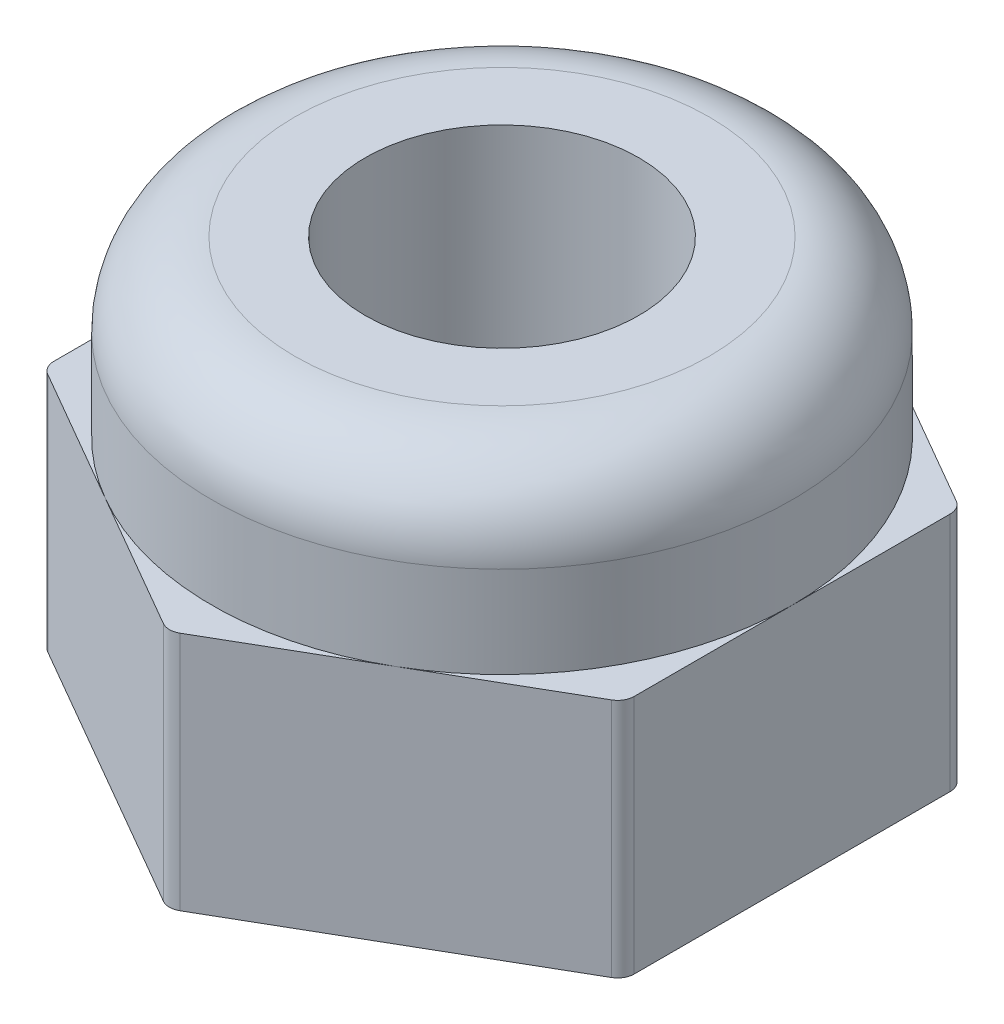
ISO-10303-21;
HEADER;
FILE_DESCRIPTION(('STEP AP214'),'2;1');
FILE_NAME('part.step','',(''),(''),'','','');
FILE_SCHEMA(('AUTOMOTIVE_DESIGN { 1 0 10303 214 1 1 1 1 }'));
ENDSEC;
DATA;
#1=APPLICATION_CONTEXT('core data for automotive mechanical design processes');
#2=APPLICATION_PROTOCOL_DEFINITION('international standard','automotive_design',2000,#1);
#3=PRODUCT_CONTEXT('',#1,'mechanical');
#4=PRODUCT('Part','Part','',(#3));
#5=PRODUCT_RELATED_PRODUCT_CATEGORY('part','',(#4));
#6=PRODUCT_DEFINITION_FORMATION('','',#4);
#7=PRODUCT_DEFINITION_CONTEXT('part definition',#1,'design');
#8=PRODUCT_DEFINITION('design','',#6,#7);
#9=PRODUCT_DEFINITION_SHAPE('','',#8);
#10=(LENGTH_UNIT() NAMED_UNIT(*) SI_UNIT(.MILLI.,.METRE.));
#11=(NAMED_UNIT(*) PLANE_ANGLE_UNIT() SI_UNIT($,.RADIAN.));
#12=(NAMED_UNIT(*) SI_UNIT($,.STERADIAN.) SOLID_ANGLE_UNIT());
#13=UNCERTAINTY_MEASURE_WITH_UNIT(LENGTH_MEASURE(1.E-05),#10,'distance_accuracy_value','');
#14=(GEOMETRIC_REPRESENTATION_CONTEXT(3) GLOBAL_UNCERTAINTY_ASSIGNED_CONTEXT((#13)) GLOBAL_UNIT_ASSIGNED_CONTEXT((#10,
#11,#12)) REPRESENTATION_CONTEXT('',''));
#15=CARTESIAN_POINT('',(0.,0.,0.));
#16=DIRECTION('',(0.,0.,1.));
#17=DIRECTION('',(1.,0.,0.));
#18=AXIS2_PLACEMENT_3D('',#15,#16,#17);
#19=CARTESIAN_POINT('',(0.,0.,0.));
#20=DIRECTION('',(0.,1.,0.));
#21=DIRECTION('',(0.,0.,1.));
#22=AXIS2_PLACEMENT_3D('',#19,#20,#21);
#23=PLANE('',#22);
#24=DIRECTION('',(-0.866025403784439,0.,-0.5));
#25=VECTOR('',#24,1.);
#26=CARTESIAN_POINT('',(3.5,0.,-2.02072594216369));
#27=LINE('',#26,#25);
#28=CARTESIAN_POINT('',(3.4,0.,-2.07846096908265));
#29=VERTEX_POINT('',#28);
#30=CARTESIAN_POINT('',(0.100000000000001,0.,-3.98371685740842));
#31=VERTEX_POINT('',#30);
#32=EDGE_CURVE('E228',#29,#31,#27,.T.);
#33=ORIENTED_EDGE('',*,*,#32,.F.);
#34=CARTESIAN_POINT('',(3.3,0.,-1.90525588832577));
#35=DIRECTION('',(0.,1.,0.));
#36=DIRECTION('',(0.,0.,1.));
#37=AXIS2_PLACEMENT_3D('',#34,#35,#36);
#38=CIRCLE('',#37,0.2);
#39=CARTESIAN_POINT('',(3.5,0.,-1.90525588832577));
#40=VERTEX_POINT('',#39);
#41=EDGE_CURVE('E271',#29,#40,#38,.F.);
#42=ORIENTED_EDGE('',*,*,#41,.T.);
#43=DIRECTION('',(0.,0.,-1.));
#44=VECTOR('',#43,1.);
#45=CARTESIAN_POINT('',(3.5,0.,2.02072594216369));
#46=LINE('',#45,#44);
#47=CARTESIAN_POINT('',(3.5,0.,1.90525588832576));
#48=VERTEX_POINT('',#47);
#49=EDGE_CURVE('E224',#48,#40,#46,.T.);
#50=ORIENTED_EDGE('',*,*,#49,.F.);
#51=CARTESIAN_POINT('',(3.3,0.,1.90525588832576));
#52=DIRECTION('',(0.,1.,0.));
#53=DIRECTION('',(0.,0.,1.));
#54=AXIS2_PLACEMENT_3D('',#51,#52,#53);
#55=CIRCLE('',#54,0.2);
#56=CARTESIAN_POINT('',(3.4,0.,2.07846096908265));
#57=VERTEX_POINT('',#56);
#58=EDGE_CURVE('E268',#48,#57,#55,.F.);
#59=ORIENTED_EDGE('',*,*,#58,.T.);
#60=DIRECTION('',(0.866025403784438,0.,-0.5));
#61=VECTOR('',#60,1.);
#62=CARTESIAN_POINT('',(0.,0.,4.04145188432738));
#63=LINE('',#62,#61);
#64=CARTESIAN_POINT('',(0.0999999999999992,0.,3.98371685740842));
#65=VERTEX_POINT('',#64);
#66=EDGE_CURVE('E186',#65,#57,#63,.T.);
#67=ORIENTED_EDGE('',*,*,#66,.F.);
#68=CARTESIAN_POINT('',(0.,0.,3.81051177665153));
#69=DIRECTION('',(0.,1.,0.));
#70=DIRECTION('',(0.,0.,1.));
#71=AXIS2_PLACEMENT_3D('',#68,#69,#70);
#72=CIRCLE('',#71,0.2);
#73=CARTESIAN_POINT('',(-0.100000000000002,0.,3.98371685740842));
#74=VERTEX_POINT('',#73);
#75=EDGE_CURVE('E265',#65,#74,#72,.F.);
#76=ORIENTED_EDGE('',*,*,#75,.T.);
#77=DIRECTION('',(0.866025403784438,0.,0.5));
#78=VECTOR('',#77,1.);
#79=CARTESIAN_POINT('',(-3.5,0.,2.02072594216369));
#80=LINE('',#79,#78);
#81=CARTESIAN_POINT('',(-3.4,0.,2.07846096908265));
#82=VERTEX_POINT('',#81);
#83=EDGE_CURVE('E176',#82,#74,#80,.T.);
#84=ORIENTED_EDGE('',*,*,#83,.F.);
#85=CARTESIAN_POINT('',(-3.3,0.,1.90525588832577));
#86=DIRECTION('',(0.,1.,0.));
#87=DIRECTION('',(0.,0.,1.));
#88=AXIS2_PLACEMENT_3D('',#85,#86,#87);
#89=CIRCLE('',#88,0.2);
#90=CARTESIAN_POINT('',(-3.5,0.,1.90525588832577));
#91=VERTEX_POINT('',#90);
#92=EDGE_CURVE('E262',#82,#91,#89,.F.);
#93=ORIENTED_EDGE('',*,*,#92,.T.);
#94=DIRECTION('',(0.,0.,1.));
#95=VECTOR('',#94,1.);
#96=CARTESIAN_POINT('',(-3.5,0.,-2.02072594216369));
#97=LINE('',#96,#95);
#98=CARTESIAN_POINT('',(-3.5,0.,-1.90525588832576));
#99=VERTEX_POINT('',#98);
#100=EDGE_CURVE('E235',#99,#91,#97,.T.);
#101=ORIENTED_EDGE('',*,*,#100,.F.);
#102=CARTESIAN_POINT('',(-3.3,0.,-1.90525588832576));
#103=DIRECTION('',(0.,1.,0.));
#104=DIRECTION('',(0.,0.,1.));
#105=AXIS2_PLACEMENT_3D('',#102,#103,#104);
#106=CIRCLE('',#105,0.2);
#107=CARTESIAN_POINT('',(-3.4,0.,-2.07846096908265));
#108=VERTEX_POINT('',#107);
#109=EDGE_CURVE('E259',#99,#108,#106,.F.);
#110=ORIENTED_EDGE('',*,*,#109,.T.);
#111=DIRECTION('',(-0.866025403784438,0.,0.5));
#112=VECTOR('',#111,1.);
#113=CARTESIAN_POINT('',(0.,0.,-4.04145188432738));
#114=LINE('',#113,#112);
#115=CARTESIAN_POINT('',(-0.0999999999999989,0.,-3.98371685740842));
#116=VERTEX_POINT('',#115);
#117=EDGE_CURVE('E232',#116,#108,#114,.T.);
#118=ORIENTED_EDGE('',*,*,#117,.F.);
#119=CARTESIAN_POINT('',(0.,0.,-3.81051177665153));
#120=DIRECTION('',(0.,1.,0.));
#121=DIRECTION('',(0.,0.,1.));
#122=AXIS2_PLACEMENT_3D('',#119,#120,#121);
#123=CIRCLE('',#122,0.2);
#124=EDGE_CURVE('E256',#116,#31,#123,.F.);
#125=ORIENTED_EDGE('',*,*,#124,.T.);
#126=EDGE_LOOP('',(#33,#42,#50,#59,#67,#76,#84,#93,#101,#110,#118,#125));
#127=FACE_BOUND('',#126,.T.);
#128=CARTESIAN_POINT('',(0.,0.,0.));
#129=DIRECTION('',(0.,-1.,0.));
#130=DIRECTION('',(0.,0.,-1.));
#131=AXIS2_PLACEMENT_3D('',#128,#129,#130);
#132=CIRCLE('',#131,2.025);
#133=CARTESIAN_POINT('',(0.,0.,-2.025));
#134=VERTEX_POINT('',#133);
#135=EDGE_CURVE('E590',#134,#134,#132,.T.);
#136=ORIENTED_EDGE('',*,*,#135,.F.);
#137=EDGE_LOOP('',(#136));
#138=FACE_BOUND('',#137,.T.);
#139=ADVANCED_FACE('F41',(#127,#138),#23,.F.);
#140=CARTESIAN_POINT('',(0.,2.9,0.));
#141=DIRECTION('',(0.,1.,0.));
#142=DIRECTION('',(0.,0.,1.));
#143=AXIS2_PLACEMENT_3D('',#140,#141,#142);
#144=PLANE('',#143);
#145=DIRECTION('',(0.866025403784438,0.,-0.5));
#146=VECTOR('',#145,1.);
#147=CARTESIAN_POINT('',(0.,2.9,4.04145188432738));
#148=LINE('',#147,#146);
#149=CARTESIAN_POINT('',(1.75,2.9,3.03108891324553));
#150=VERTEX_POINT('',#149);
#151=CARTESIAN_POINT('',(3.4,2.9,2.07846096908265));
#152=VERTEX_POINT('',#151);
#153=EDGE_CURVE('E165',#150,#152,#148,.T.);
#154=ORIENTED_EDGE('',*,*,#153,.T.);
#155=CARTESIAN_POINT('',(3.3,2.9,1.90525588832576));
#156=DIRECTION('',(0.,1.,0.));
#157=DIRECTION('',(0.,0.,1.));
#158=AXIS2_PLACEMENT_3D('',#155,#156,#157);
#159=CIRCLE('',#158,0.2);
#160=CARTESIAN_POINT('',(3.5,2.9,1.90525588832576));
#161=VERTEX_POINT('',#160);
#162=EDGE_CURVE('E289',#152,#161,#159,.T.);
#163=ORIENTED_EDGE('',*,*,#162,.T.);
#164=DIRECTION('',(0.,0.,-1.));
#165=VECTOR('',#164,1.);
#166=CARTESIAN_POINT('',(3.5,2.9,2.02072594216369));
#167=LINE('',#166,#165);
#168=CARTESIAN_POINT('',(3.5,2.9,0.));
#169=VERTEX_POINT('',#168);
#170=EDGE_CURVE('E181',#161,#169,#167,.T.);
#171=ORIENTED_EDGE('',*,*,#170,.T.);
#172=CARTESIAN_POINT('',(0.,2.9,0.));
#173=DIRECTION('',(0.,1.,0.));
#174=DIRECTION('',(0.,0.,1.));
#175=AXIS2_PLACEMENT_3D('',#172,#173,#174);
#176=CIRCLE('',#175,3.5);
#177=EDGE_CURVE('E178',#150,#169,#176,.T.);
#178=ORIENTED_EDGE('',*,*,#177,.F.);
#179=EDGE_LOOP('',(#154,#163,#171,#178));
#180=FACE_BOUND('',#179,.T.);
#181=ADVANCED_FACE('F179',(#180),#144,.T.);
#182=CARTESIAN_POINT('',(3.5,2.9,-1.90525588832577));
#183=VERTEX_POINT('',#182);
#184=EDGE_CURVE('E164',#169,#183,#167,.T.);
#185=ORIENTED_EDGE('',*,*,#184,.T.);
#186=CARTESIAN_POINT('',(3.3,2.9,-1.90525588832577));
#187=DIRECTION('',(0.,1.,0.));
#188=DIRECTION('',(0.,0.,1.));
#189=AXIS2_PLACEMENT_3D('',#186,#187,#188);
#190=CIRCLE('',#189,0.2);
#191=CARTESIAN_POINT('',(3.4,2.9,-2.07846096908265));
#192=VERTEX_POINT('',#191);
#193=EDGE_CURVE('E281',#183,#192,#190,.T.);
#194=ORIENTED_EDGE('',*,*,#193,.T.);
#195=DIRECTION('',(-0.866025403784439,0.,-0.5));
#196=VECTOR('',#195,1.);
#197=CARTESIAN_POINT('',(3.5,2.9,-2.02072594216369));
#198=LINE('',#197,#196);
#199=CARTESIAN_POINT('',(1.75,2.9,-3.03108891324554));
#200=VERTEX_POINT('',#199);
#201=EDGE_CURVE('E206',#192,#200,#198,.T.);
#202=ORIENTED_EDGE('',*,*,#201,.T.);
#203=EDGE_CURVE('E187',#169,#200,#176,.T.);
#204=ORIENTED_EDGE('',*,*,#203,.F.);
#205=EDGE_LOOP('',(#185,#194,#202,#204));
#206=FACE_BOUND('',#205,.T.);
#207=ADVANCED_FACE('F384',(#206),#144,.T.);
#208=CARTESIAN_POINT('',(0.100000000000001,2.9,-3.98371685740842));
#209=VERTEX_POINT('',#208);
#210=EDGE_CURVE('E205',#200,#209,#198,.T.);
#211=ORIENTED_EDGE('',*,*,#210,.T.);
#212=CARTESIAN_POINT('',(0.,2.9,-3.81051177665153));
#213=DIRECTION('',(0.,1.,0.));
#214=DIRECTION('',(0.,0.,1.));
#215=AXIS2_PLACEMENT_3D('',#212,#213,#214);
#216=CIRCLE('',#215,0.2);
#217=CARTESIAN_POINT('',(-0.0999999999999989,2.9,-3.98371685740842));
#218=VERTEX_POINT('',#217);
#219=EDGE_CURVE('E11',#209,#218,#216,.T.);
#220=ORIENTED_EDGE('',*,*,#219,.T.);
#221=DIRECTION('',(-0.866025403784438,0.,0.5));
#222=VECTOR('',#221,1.);
#223=CARTESIAN_POINT('',(0.,2.9,-4.04145188432738));
#224=LINE('',#223,#222);
#225=CARTESIAN_POINT('',(-1.75,2.9,-3.03108891324553));
#226=VERTEX_POINT('',#225);
#227=EDGE_CURVE('E210',#218,#226,#224,.T.);
#228=ORIENTED_EDGE('',*,*,#227,.T.);
#229=EDGE_CURVE('E378',#200,#226,#176,.T.);
#230=ORIENTED_EDGE('',*,*,#229,.F.);
#231=EDGE_LOOP('',(#211,#220,#228,#230));
#232=FACE_BOUND('',#231,.T.);
#233=ADVANCED_FACE('F382',(#232),#144,.T.);
#234=CARTESIAN_POINT('',(-3.4,2.9,-2.07846096908265));
#235=VERTEX_POINT('',#234);
#236=EDGE_CURVE('E209',#226,#235,#224,.T.);
#237=ORIENTED_EDGE('',*,*,#236,.T.);
#238=CARTESIAN_POINT('',(-3.3,2.9,-1.90525588832576));
#239=DIRECTION('',(0.,1.,0.));
#240=DIRECTION('',(0.,0.,1.));
#241=AXIS2_PLACEMENT_3D('',#238,#239,#240);
#242=CIRCLE('',#241,0.2);
#243=CARTESIAN_POINT('',(-3.5,2.9,-1.90525588832576));
#244=VERTEX_POINT('',#243);
#245=EDGE_CURVE('E51',#235,#244,#242,.T.);
#246=ORIENTED_EDGE('',*,*,#245,.T.);
#247=DIRECTION('',(0.,0.,1.));
#248=VECTOR('',#247,1.);
#249=CARTESIAN_POINT('',(-3.5,2.9,-2.02072594216369));
#250=LINE('',#249,#248);
#251=CARTESIAN_POINT('',(-3.5,2.9,0.));
#252=VERTEX_POINT('',#251);
#253=EDGE_CURVE('E214',#244,#252,#250,.T.);
#254=ORIENTED_EDGE('',*,*,#253,.T.);
#255=EDGE_CURVE('E197',#226,#252,#176,.T.);
#256=ORIENTED_EDGE('',*,*,#255,.F.);
#257=EDGE_LOOP('',(#237,#246,#254,#256));
#258=FACE_BOUND('',#257,.T.);
#259=ADVANCED_FACE('F321',(#258),#144,.T.);
#260=CARTESIAN_POINT('',(-3.5,2.9,1.90525588832577));
#261=VERTEX_POINT('',#260);
#262=EDGE_CURVE('E213',#252,#261,#250,.T.);
#263=ORIENTED_EDGE('',*,*,#262,.T.);
#264=CARTESIAN_POINT('',(-3.3,2.9,1.90525588832577));
#265=DIRECTION('',(0.,1.,0.));
#266=DIRECTION('',(0.,0.,1.));
#267=AXIS2_PLACEMENT_3D('',#264,#265,#266);
#268=CIRCLE('',#267,0.2);
#269=CARTESIAN_POINT('',(-3.4,2.9,2.07846096908265));
#270=VERTEX_POINT('',#269);
#271=EDGE_CURVE('E308',#261,#270,#268,.T.);
#272=ORIENTED_EDGE('',*,*,#271,.T.);
#273=DIRECTION('',(0.866025403784438,0.,0.5));
#274=VECTOR('',#273,1.);
#275=CARTESIAN_POINT('',(-3.5,2.9,2.02072594216369));
#276=LINE('',#275,#274);
#277=CARTESIAN_POINT('',(-1.75,2.9,3.03108891324554));
#278=VERTEX_POINT('',#277);
#279=EDGE_CURVE('E218',#270,#278,#276,.T.);
#280=ORIENTED_EDGE('',*,*,#279,.T.);
#281=EDGE_CURVE('E193',#252,#278,#176,.T.);
#282=ORIENTED_EDGE('',*,*,#281,.F.);
#283=EDGE_LOOP('',(#263,#272,#280,#282));
#284=FACE_BOUND('',#283,.T.);
#285=ADVANCED_FACE('F370',(#284),#144,.T.);
#286=CARTESIAN_POINT('',(0.,2.9,4.04145188432738));
#287=DIRECTION('',(-0.5,0.,-0.866025403784439));
#288=DIRECTION('',(-0.866025403784439,0.,0.5));
#289=AXIS2_PLACEMENT_3D('',#286,#287,#288);
#290=PLANE('',#289);
#291=ORIENTED_EDGE('',*,*,#66,.T.);
#292=DIRECTION('',(0.,-1.,0.));
#293=VECTOR('',#292,1.);
#294=CARTESIAN_POINT('',(3.4,2.9,2.07846096908265));
#295=LINE('',#294,#293);
#296=EDGE_CURVE('E172',#57,#152,#295,.F.);
#297=ORIENTED_EDGE('',*,*,#296,.T.);
#298=ORIENTED_EDGE('',*,*,#153,.F.);
#299=CARTESIAN_POINT('',(0.0999999999999992,2.9,3.98371685740842));
#300=VERTEX_POINT('',#299);
#301=EDGE_CURVE('E151',#300,#150,#148,.T.);
#302=ORIENTED_EDGE('',*,*,#301,.F.);
#303=DIRECTION('',(0.,-1.,0.));
#304=VECTOR('',#303,1.);
#305=CARTESIAN_POINT('',(0.0999999999999993,2.9,3.98371685740842));
#306=LINE('',#305,#304);
#307=EDGE_CURVE('E284',#300,#65,#306,.T.);
#308=ORIENTED_EDGE('',*,*,#307,.T.);
#309=EDGE_LOOP('',(#291,#297,#298,#302,#308));
#310=FACE_BOUND('',#309,.T.);
#311=ADVANCED_FACE('F170',(#310),#290,.F.);
#312=CARTESIAN_POINT('',(3.5,2.9,2.02072594216369));
#313=DIRECTION('',(-1.,0.,0.));
#314=DIRECTION('',(0.,0.,1.));
#315=AXIS2_PLACEMENT_3D('',#312,#313,#314);
#316=PLANE('',#315);
#317=ORIENTED_EDGE('',*,*,#49,.T.);
#318=DIRECTION('',(0.,-1.,0.));
#319=VECTOR('',#318,1.);
#320=CARTESIAN_POINT('',(3.5,2.9,-1.90525588832577));
#321=LINE('',#320,#319);
#322=EDGE_CURVE('E278',#40,#183,#321,.F.);
#323=ORIENTED_EDGE('',*,*,#322,.T.);
#324=ORIENTED_EDGE('',*,*,#184,.F.);
#325=ORIENTED_EDGE('',*,*,#170,.F.);
#326=DIRECTION('',(0.,-1.,0.));
#327=VECTOR('',#326,1.);
#328=CARTESIAN_POINT('',(3.5,2.9,1.90525588832576));
#329=LINE('',#328,#327);
#330=EDGE_CURVE('E274',#161,#48,#329,.T.);
#331=ORIENTED_EDGE('',*,*,#330,.T.);
#332=EDGE_LOOP('',(#317,#323,#324,#325,#331));
#333=FACE_BOUND('',#332,.T.);
#334=ADVANCED_FACE('F350',(#333),#316,.F.);
#335=CARTESIAN_POINT('',(3.5,2.9,-2.02072594216369));
#336=DIRECTION('',(-0.5,0.,0.866025403784439));
#337=DIRECTION('',(0.866025403784439,0.,0.5));
#338=AXIS2_PLACEMENT_3D('',#335,#336,#337);
#339=PLANE('',#338);
#340=ORIENTED_EDGE('',*,*,#201,.F.);
#341=DIRECTION('',(0.,-1.,0.));
#342=VECTOR('',#341,1.);
#343=CARTESIAN_POINT('',(3.4,2.9,-2.07846096908265));
#344=LINE('',#343,#342);
#345=EDGE_CURVE('E252',#192,#29,#344,.T.);
#346=ORIENTED_EDGE('',*,*,#345,.T.);
#347=ORIENTED_EDGE('',*,*,#32,.T.);
#348=DIRECTION('',(0.,-1.,0.));
#349=VECTOR('',#348,1.);
#350=CARTESIAN_POINT('',(0.100000000000002,2.9,-3.98371685740842));
#351=LINE('',#350,#349);
#352=EDGE_CURVE('E249',#31,#209,#351,.F.);
#353=ORIENTED_EDGE('',*,*,#352,.T.);
#354=ORIENTED_EDGE('',*,*,#210,.F.);
#355=EDGE_LOOP('',(#340,#346,#347,#353,#354));
#356=FACE_BOUND('',#355,.T.);
#357=ADVANCED_FACE('F341',(#356),#339,.F.);
#358=CARTESIAN_POINT('',(0.,2.9,-4.04145188432738));
#359=DIRECTION('',(0.5,0.,0.866025403784439));
#360=DIRECTION('',(0.866025403784439,0.,-0.5));
#361=AXIS2_PLACEMENT_3D('',#358,#359,#360);
#362=PLANE('',#361);
#363=ORIENTED_EDGE('',*,*,#117,.T.);
#364=DIRECTION('',(0.,-1.,0.));
#365=VECTOR('',#364,1.);
#366=CARTESIAN_POINT('',(-3.4,2.9,-2.07846096908265));
#367=LINE('',#366,#365);
#368=EDGE_CURVE('E64',#108,#235,#367,.F.);
#369=ORIENTED_EDGE('',*,*,#368,.T.);
#370=ORIENTED_EDGE('',*,*,#236,.F.);
#371=ORIENTED_EDGE('',*,*,#227,.F.);
#372=DIRECTION('',(0.,-1.,0.));
#373=VECTOR('',#372,1.);
#374=CARTESIAN_POINT('',(-0.099999999999999,2.9,-3.98371685740842));
#375=LINE('',#374,#373);
#376=EDGE_CURVE('E311',#218,#116,#375,.T.);
#377=ORIENTED_EDGE('',*,*,#376,.T.);
#378=EDGE_LOOP('',(#363,#369,#370,#371,#377));
#379=FACE_BOUND('',#378,.T.);
#380=ADVANCED_FACE('F335',(#379),#362,.F.);
#381=CARTESIAN_POINT('',(-3.5,2.9,-2.02072594216369));
#382=DIRECTION('',(1.,0.,0.));
#383=DIRECTION('',(0.,0.,-1.));
#384=AXIS2_PLACEMENT_3D('',#381,#382,#383);
#385=PLANE('',#384);
#386=ORIENTED_EDGE('',*,*,#100,.T.);
#387=DIRECTION('',(0.,-1.,0.));
#388=VECTOR('',#387,1.);
#389=CARTESIAN_POINT('',(-3.5,2.9,1.90525588832577));
#390=LINE('',#389,#388);
#391=EDGE_CURVE('E305',#91,#261,#390,.F.);
#392=ORIENTED_EDGE('',*,*,#391,.T.);
#393=ORIENTED_EDGE('',*,*,#262,.F.);
#394=ORIENTED_EDGE('',*,*,#253,.F.);
#395=DIRECTION('',(0.,-1.,0.));
#396=VECTOR('',#395,1.);
#397=CARTESIAN_POINT('',(-3.5,2.9,-1.90525588832576));
#398=LINE('',#397,#396);
#399=EDGE_CURVE('E301',#244,#99,#398,.T.);
#400=ORIENTED_EDGE('',*,*,#399,.T.);
#401=EDGE_LOOP('',(#386,#392,#393,#394,#400));
#402=FACE_BOUND('',#401,.T.);
#403=ADVANCED_FACE('F327',(#402),#385,.F.);
#404=CARTESIAN_POINT('',(-3.5,2.9,2.02072594216369));
#405=DIRECTION('',(0.5,0.,-0.866025403784439));
#406=DIRECTION('',(-0.866025403784439,0.,-0.5));
#407=AXIS2_PLACEMENT_3D('',#404,#405,#406);
#408=PLANE('',#407);
#409=ORIENTED_EDGE('',*,*,#83,.T.);
#410=DIRECTION('',(0.,-1.,0.));
#411=VECTOR('',#410,1.);
#412=CARTESIAN_POINT('',(-0.1,2.9,3.98371685740842));
#413=LINE('',#412,#411);
#414=CARTESIAN_POINT('',(-0.100000000000002,2.9,3.98371685740842));
#415=VERTEX_POINT('',#414);
#416=EDGE_CURVE('E296',#74,#415,#413,.F.);
#417=ORIENTED_EDGE('',*,*,#416,.T.);
#418=EDGE_CURVE('E217',#278,#415,#276,.T.);
#419=ORIENTED_EDGE('',*,*,#418,.F.);
#420=ORIENTED_EDGE('',*,*,#279,.F.);
#421=DIRECTION('',(0.,-1.,0.));
#422=VECTOR('',#421,1.);
#423=CARTESIAN_POINT('',(-3.4,2.9,2.07846096908265));
#424=LINE('',#423,#422);
#425=EDGE_CURVE('E292',#270,#82,#424,.T.);
#426=ORIENTED_EDGE('',*,*,#425,.T.);
#427=EDGE_LOOP('',(#409,#417,#419,#420,#426));
#428=FACE_BOUND('',#427,.T.);
#429=ADVANCED_FACE('F362',(#428),#408,.F.);
#430=ORIENTED_EDGE('',*,*,#418,.T.);
#431=CARTESIAN_POINT('',(0.,2.9,3.81051177665153));
#432=DIRECTION('',(0.,1.,0.));
#433=DIRECTION('',(0.,0.,1.));
#434=AXIS2_PLACEMENT_3D('',#431,#432,#433);
#435=CIRCLE('',#434,0.2);
#436=EDGE_CURVE('E159',#415,#300,#435,.T.);
#437=ORIENTED_EDGE('',*,*,#436,.T.);
#438=ORIENTED_EDGE('',*,*,#301,.T.);
#439=EDGE_CURVE('E156',#278,#150,#176,.T.);
#440=ORIENTED_EDGE('',*,*,#439,.F.);
#441=EDGE_LOOP('',(#430,#437,#438,#440));
#442=FACE_BOUND('',#441,.T.);
#443=ADVANCED_FACE('F154',(#442),#144,.T.);
#444=CARTESIAN_POINT('',(0.,5.,0.));
#445=DIRECTION('',(0.,-1.,0.));
#446=DIRECTION('',(0.,0.,-1.));
#447=AXIS2_PLACEMENT_3D('',#444,#445,#446);
#448=CYLINDRICAL_SURFACE('',#447,3.5);
#449=CARTESIAN_POINT('',(0.,4.,0.));
#450=DIRECTION('',(0.,-1.,0.));
#451=DIRECTION('',(0.,0.,-1.));
#452=AXIS2_PLACEMENT_3D('',#449,#450,#451);
#453=CIRCLE('',#452,3.5);
#454=CARTESIAN_POINT('',(0.,4.,-3.5));
#455=VERTEX_POINT('',#454);
#456=EDGE_CURVE('E221',#455,#455,#453,.T.);
#457=ORIENTED_EDGE('',*,*,#456,.T.);
#458=EDGE_LOOP('',(#457));
#459=FACE_BOUND('',#458,.T.);
#460=ORIENTED_EDGE('',*,*,#439,.T.);
#461=ORIENTED_EDGE('',*,*,#177,.T.);
#462=ORIENTED_EDGE('',*,*,#203,.T.);
#463=ORIENTED_EDGE('',*,*,#229,.T.);
#464=ORIENTED_EDGE('',*,*,#255,.T.);
#465=ORIENTED_EDGE('',*,*,#281,.T.);
#466=EDGE_LOOP('',(#460,#461,#462,#463,#464,#465));
#467=FACE_BOUND('',#466,.T.);
#468=ADVANCED_FACE('F190',(#459,#467),#448,.T.);
#469=CARTESIAN_POINT('',(0.,5.,0.));
#470=DIRECTION('',(0.,-1.,0.));
#471=DIRECTION('',(0.,0.,-1.));
#472=AXIS2_PLACEMENT_3D('',#469,#470,#471);
#473=PLANE('',#472);
#474=CARTESIAN_POINT('',(0.,5.,0.));
#475=DIRECTION('',(0.,-1.,0.));
#476=DIRECTION('',(0.,0.,-1.));
#477=AXIS2_PLACEMENT_3D('',#474,#475,#476);
#478=CIRCLE('',#477,1.65);
#479=CARTESIAN_POINT('',(0.,5.,-1.65));
#480=VERTEX_POINT('',#479);
#481=EDGE_CURVE('E45',#480,#480,#478,.T.);
#482=ORIENTED_EDGE('',*,*,#481,.T.);
#483=EDGE_LOOP('',(#482));
#484=FACE_BOUND('',#483,.T.);
#485=CARTESIAN_POINT('',(0.,5.,0.));
#486=DIRECTION('',(0.,-1.,0.));
#487=DIRECTION('',(0.,0.,-1.));
#488=AXIS2_PLACEMENT_3D('',#485,#486,#487);
#489=CIRCLE('',#488,2.5);
#490=CARTESIAN_POINT('',(0.,5.,-2.5));
#491=VERTEX_POINT('',#490);
#492=EDGE_CURVE('E245',#491,#491,#489,.F.);
#493=ORIENTED_EDGE('',*,*,#492,.T.);
#494=EDGE_LOOP('',(#493));
#495=FACE_BOUND('',#494,.T.);
#496=ADVANCED_FACE('F413',(#484,#495),#473,.F.);
#497=CARTESIAN_POINT('',(0.,4.,0.));
#498=DIRECTION('',(0.,-1.,0.));
#499=DIRECTION('',(0.,0.,-1.));
#500=AXIS2_PLACEMENT_3D('',#497,#498,#499);
#501=TOROIDAL_SURFACE('',#500,2.5,1.);
#502=ORIENTED_EDGE('',*,*,#492,.F.);
#503=EDGE_LOOP('',(#502));
#504=FACE_BOUND('',#503,.T.);
#505=ORIENTED_EDGE('',*,*,#456,.F.);
#506=EDGE_LOOP('',(#505));
#507=FACE_BOUND('',#506,.T.);
#508=ADVANCED_FACE('F410',(#504,#507),#501,.T.);
#509=CARTESIAN_POINT('',(3.3,2.9,-1.90525588832577));
#510=DIRECTION('',(0.,-1.,0.));
#511=DIRECTION('',(0.,0.,-1.));
#512=AXIS2_PLACEMENT_3D('',#509,#510,#511);
#513=CYLINDRICAL_SURFACE('',#512,0.2);
#514=ORIENTED_EDGE('',*,*,#193,.F.);
#515=ORIENTED_EDGE('',*,*,#322,.F.);
#516=ORIENTED_EDGE('',*,*,#41,.F.);
#517=ORIENTED_EDGE('',*,*,#345,.F.);
#518=EDGE_LOOP('',(#514,#515,#516,#517));
#519=FACE_BOUND('',#518,.T.);
#520=ADVANCED_FACE('F346',(#519),#513,.T.);
#521=CARTESIAN_POINT('',(3.3,2.9,1.90525588832576));
#522=DIRECTION('',(0.,-1.,0.));
#523=DIRECTION('',(0.,0.,-1.));
#524=AXIS2_PLACEMENT_3D('',#521,#522,#523);
#525=CYLINDRICAL_SURFACE('',#524,0.2);
#526=ORIENTED_EDGE('',*,*,#162,.F.);
#527=ORIENTED_EDGE('',*,*,#296,.F.);
#528=ORIENTED_EDGE('',*,*,#58,.F.);
#529=ORIENTED_EDGE('',*,*,#330,.F.);
#530=EDGE_LOOP('',(#526,#527,#528,#529));
#531=FACE_BOUND('',#530,.T.);
#532=ADVANCED_FACE('F355',(#531),#525,.T.);
#533=CARTESIAN_POINT('',(0.,2.9,3.81051177665153));
#534=DIRECTION('',(0.,-1.,0.));
#535=DIRECTION('',(0.,0.,-1.));
#536=AXIS2_PLACEMENT_3D('',#533,#534,#535);
#537=CYLINDRICAL_SURFACE('',#536,0.2);
#538=ORIENTED_EDGE('',*,*,#436,.F.);
#539=ORIENTED_EDGE('',*,*,#416,.F.);
#540=ORIENTED_EDGE('',*,*,#75,.F.);
#541=ORIENTED_EDGE('',*,*,#307,.F.);
#542=EDGE_LOOP('',(#538,#539,#540,#541));
#543=FACE_BOUND('',#542,.T.);
#544=ADVANCED_FACE('F358',(#543),#537,.T.);
#545=CARTESIAN_POINT('',(-3.3,2.9,1.90525588832577));
#546=DIRECTION('',(0.,-1.,0.));
#547=DIRECTION('',(0.,0.,-1.));
#548=AXIS2_PLACEMENT_3D('',#545,#546,#547);
#549=CYLINDRICAL_SURFACE('',#548,0.2);
#550=ORIENTED_EDGE('',*,*,#271,.F.);
#551=ORIENTED_EDGE('',*,*,#391,.F.);
#552=ORIENTED_EDGE('',*,*,#92,.F.);
#553=ORIENTED_EDGE('',*,*,#425,.F.);
#554=EDGE_LOOP('',(#550,#551,#552,#553));
#555=FACE_BOUND('',#554,.T.);
#556=ADVANCED_FACE('F367',(#555),#549,.T.);
#557=CARTESIAN_POINT('',(-3.3,2.9,-1.90525588832576));
#558=DIRECTION('',(0.,-1.,0.));
#559=DIRECTION('',(0.,0.,-1.));
#560=AXIS2_PLACEMENT_3D('',#557,#558,#559);
#561=CYLINDRICAL_SURFACE('',#560,0.2);
#562=ORIENTED_EDGE('',*,*,#245,.F.);
#563=ORIENTED_EDGE('',*,*,#368,.F.);
#564=ORIENTED_EDGE('',*,*,#109,.F.);
#565=ORIENTED_EDGE('',*,*,#399,.F.);
#566=EDGE_LOOP('',(#562,#563,#564,#565));
#567=FACE_BOUND('',#566,.T.);
#568=ADVANCED_FACE('F330',(#567),#561,.T.);
#569=CARTESIAN_POINT('',(0.,2.9,-3.81051177665153));
#570=DIRECTION('',(0.,-1.,0.));
#571=DIRECTION('',(0.,0.,-1.));
#572=AXIS2_PLACEMENT_3D('',#569,#570,#571);
#573=CYLINDRICAL_SURFACE('',#572,0.2);
#574=ORIENTED_EDGE('',*,*,#219,.F.);
#575=ORIENTED_EDGE('',*,*,#352,.F.);
#576=ORIENTED_EDGE('',*,*,#124,.F.);
#577=ORIENTED_EDGE('',*,*,#376,.F.);
#578=EDGE_LOOP('',(#574,#575,#576,#577));
#579=FACE_BOUND('',#578,.T.);
#580=ADVANCED_FACE('F43',(#579),#573,.T.);
#581=CARTESIAN_POINT('',(0.,0.,0.));
#582=DIRECTION('',(0.,-1.,0.));
#583=DIRECTION('',(0.,0.,-1.));
#584=AXIS2_PLACEMENT_3D('',#581,#582,#583);
#585=CYLINDRICAL_SURFACE('',#584,1.65);
#586=CARTESIAN_POINT('',(0.,0.375,0.));
#587=DIRECTION('',(0.,-1.,0.));
#588=DIRECTION('',(0.,0.,-1.));
#589=AXIS2_PLACEMENT_3D('',#586,#587,#588);
#590=CIRCLE('',#589,1.65);
#591=CARTESIAN_POINT('',(0.,0.375,-1.65));
#592=VERTEX_POINT('',#591);
#593=EDGE_CURVE('E199',#592,#592,#590,.T.);
#594=ORIENTED_EDGE('',*,*,#593,.T.);
#595=EDGE_LOOP('',(#594));
#596=FACE_BOUND('',#595,.T.);
#597=ORIENTED_EDGE('',*,*,#481,.F.);
#598=EDGE_LOOP('',(#597));
#599=FACE_BOUND('',#598,.T.);
#600=ADVANCED_FACE('F426',(#596,#599),#585,.F.);
#601=CARTESIAN_POINT('',(0.,0.,0.));
#602=DIRECTION('',(0.,-1.,0.));
#603=DIRECTION('',(0.,0.,-1.));
#604=AXIS2_PLACEMENT_3D('',#601,#602,#603);
#605=CONICAL_SURFACE('',#604,2.025,0.785398163397449);
#606=ORIENTED_EDGE('',*,*,#593,.F.);
#607=EDGE_LOOP('',(#606));
#608=FACE_BOUND('',#607,.T.);
#609=ORIENTED_EDGE('',*,*,#135,.T.);
#610=EDGE_LOOP('',(#609));
#611=FACE_BOUND('',#610,.T.);
#612=ADVANCED_FACE('F430',(#608,#611),#605,.F.);
#613=CLOSED_SHELL('',(#139,#181,#207,#233,#259,#285,#311,#334,#357,#380,#403,#429,#443,#468,
#496,#508,#520,#532,#544,#556,#568,#580,#600,#612));
#614=MANIFOLD_SOLID_BREP('B2',#613);
#615=ADVANCED_BREP_SHAPE_REPRESENTATION('',(#18,#614),#14);
#616=SHAPE_DEFINITION_REPRESENTATION(#9,#615);
ENDSEC;
END-ISO-10303-21;
